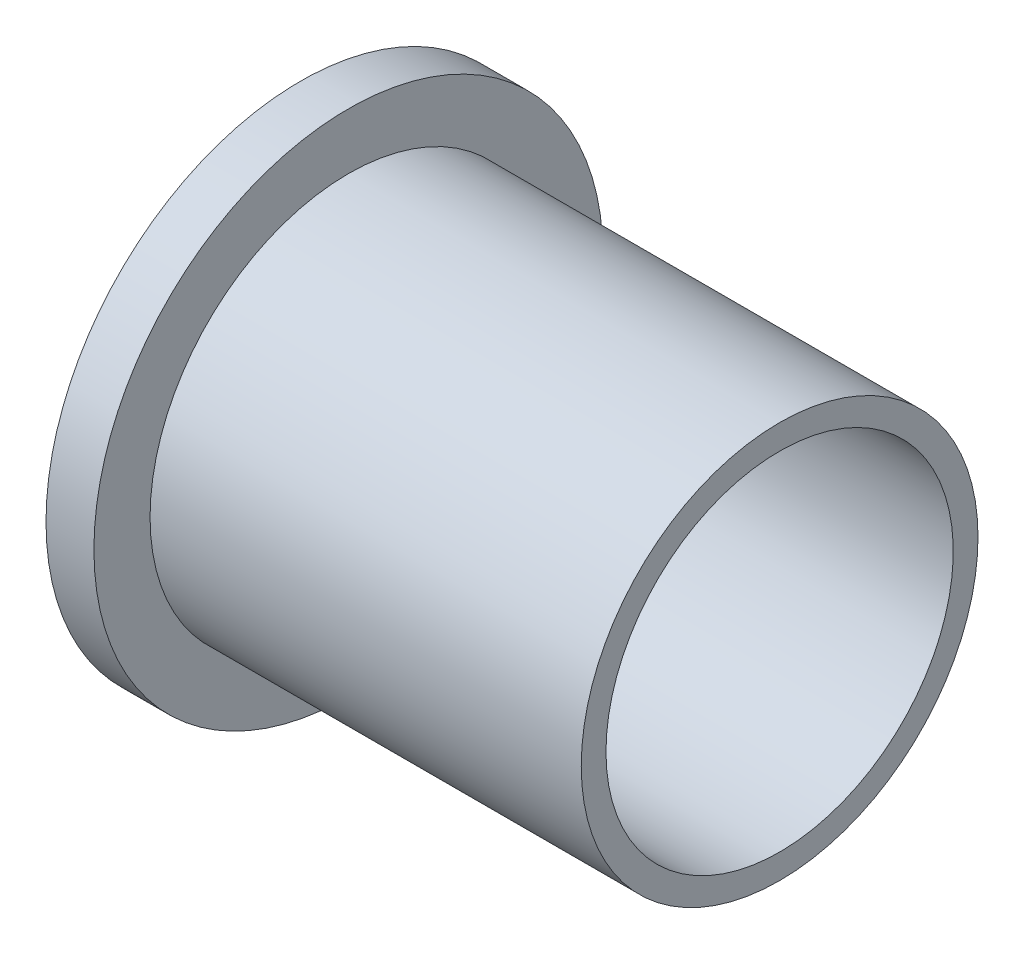
ISO-10303-21;
HEADER;
FILE_DESCRIPTION(('STEP AP214'),'2;1');
FILE_NAME('part.step','',(''),(''),'','','');
FILE_SCHEMA(('AUTOMOTIVE_DESIGN { 1 0 10303 214 1 1 1 1 }'));
ENDSEC;
DATA;
#1=APPLICATION_CONTEXT('core data for automotive mechanical design processes');
#2=APPLICATION_PROTOCOL_DEFINITION('international standard','automotive_design',2000,#1);
#3=PRODUCT_CONTEXT('',#1,'mechanical');
#4=PRODUCT('Part','Part','',(#3));
#5=PRODUCT_RELATED_PRODUCT_CATEGORY('part','',(#4));
#6=PRODUCT_DEFINITION_FORMATION('','',#4);
#7=PRODUCT_DEFINITION_CONTEXT('part definition',#1,'design');
#8=PRODUCT_DEFINITION('design','',#6,#7);
#9=PRODUCT_DEFINITION_SHAPE('','',#8);
#10=(LENGTH_UNIT() NAMED_UNIT(*) SI_UNIT(.MILLI.,.METRE.));
#11=(NAMED_UNIT(*) PLANE_ANGLE_UNIT() SI_UNIT($,.RADIAN.));
#12=(NAMED_UNIT(*) SI_UNIT($,.STERADIAN.) SOLID_ANGLE_UNIT());
#13=UNCERTAINTY_MEASURE_WITH_UNIT(LENGTH_MEASURE(1.E-05),#10,'distance_accuracy_value','');
#14=(GEOMETRIC_REPRESENTATION_CONTEXT(3) GLOBAL_UNCERTAINTY_ASSIGNED_CONTEXT((#13)) GLOBAL_UNIT_ASSIGNED_CONTEXT((#10,
#11,#12)) REPRESENTATION_CONTEXT('',''));
#15=CARTESIAN_POINT('',(0.,0.,0.));
#16=DIRECTION('',(0.,0.,1.));
#17=DIRECTION('',(1.,0.,0.));
#18=AXIS2_PLACEMENT_3D('',#15,#16,#17);
#19=CARTESIAN_POINT('',(0.,0.,0.));
#20=DIRECTION('',(-1.,0.,0.));
#21=DIRECTION('',(0.,0.,1.));
#22=AXIS2_PLACEMENT_3D('',#19,#20,#21);
#23=CYLINDRICAL_SURFACE('',#22,107.95);
#24=CARTESIAN_POINT('',(0.,0.,0.));
#25=DIRECTION('',(-1.,0.,0.));
#26=DIRECTION('',(0.,0.,1.));
#27=AXIS2_PLACEMENT_3D('',#24,#25,#26);
#28=CIRCLE('',#27,107.95);
#29=CARTESIAN_POINT('',(0.,0.,107.95));
#30=VERTEX_POINT('',#29);
#31=EDGE_CURVE('E10',#30,#30,#28,.T.);
#32=ORIENTED_EDGE('',*,*,#31,.F.);
#33=EDGE_LOOP('',(#32));
#34=FACE_BOUND('',#33,.T.);
#35=CARTESIAN_POINT('',(20.32,0.,0.));
#36=DIRECTION('',(-1.,0.,0.));
#37=DIRECTION('',(0.,0.,1.));
#38=AXIS2_PLACEMENT_3D('',#35,#36,#37);
#39=CIRCLE('',#38,107.95);
#40=CARTESIAN_POINT('',(20.32,0.,107.95));
#41=VERTEX_POINT('',#40);
#42=EDGE_CURVE('E59',#41,#41,#39,.T.);
#43=ORIENTED_EDGE('',*,*,#42,.T.);
#44=EDGE_LOOP('',(#43));
#45=FACE_BOUND('',#44,.T.);
#46=ADVANCED_FACE('F37',(#34,#45),#23,.T.);
#47=CARTESIAN_POINT('',(0.,107.95,0.));
#48=DIRECTION('',(1.,0.,0.));
#49=DIRECTION('',(0.,0.,-1.));
#50=AXIS2_PLACEMENT_3D('',#47,#48,#49);
#51=PLANE('',#50);
#52=CARTESIAN_POINT('',(0.,0.,0.));
#53=DIRECTION('',(-1.,0.,0.));
#54=DIRECTION('',(0.,0.,1.));
#55=AXIS2_PLACEMENT_3D('',#52,#53,#54);
#56=CIRCLE('',#55,73.6473);
#57=CARTESIAN_POINT('',(0.,0.,73.6473));
#58=VERTEX_POINT('',#57);
#59=EDGE_CURVE('E43',#58,#58,#56,.T.);
#60=ORIENTED_EDGE('',*,*,#59,.F.);
#61=EDGE_LOOP('',(#60));
#62=FACE_BOUND('',#61,.T.);
#63=ORIENTED_EDGE('',*,*,#31,.T.);
#64=EDGE_LOOP('',(#63));
#65=FACE_BOUND('',#64,.T.);
#66=ADVANCED_FACE('F84',(#62,#65),#51,.F.);
#67=CARTESIAN_POINT('',(0.,0.,0.));
#68=DIRECTION('',(-1.,0.,0.));
#69=DIRECTION('',(0.,0.,1.));
#70=AXIS2_PLACEMENT_3D('',#67,#68,#69);
#71=CYLINDRICAL_SURFACE('',#70,73.6473);
#72=CARTESIAN_POINT('',(203.2,0.,0.));
#73=DIRECTION('',(-1.,0.,0.));
#74=DIRECTION('',(0.,0.,1.));
#75=AXIS2_PLACEMENT_3D('',#72,#73,#74);
#76=CIRCLE('',#75,73.6473);
#77=CARTESIAN_POINT('',(203.2,0.,73.6473));
#78=VERTEX_POINT('',#77);
#79=EDGE_CURVE('E47',#78,#78,#76,.T.);
#80=ORIENTED_EDGE('',*,*,#79,.F.);
#81=EDGE_LOOP('',(#80));
#82=FACE_BOUND('',#81,.T.);
#83=ORIENTED_EDGE('',*,*,#59,.T.);
#84=EDGE_LOOP('',(#83));
#85=FACE_BOUND('',#84,.T.);
#86=ADVANCED_FACE('F79',(#82,#85),#71,.F.);
#87=CARTESIAN_POINT('',(203.2,73.6473,0.));
#88=DIRECTION('',(-1.,0.,0.));
#89=DIRECTION('',(0.,0.,1.));
#90=AXIS2_PLACEMENT_3D('',#87,#88,#89);
#91=PLANE('',#90);
#92=CARTESIAN_POINT('',(203.2,0.,0.));
#93=DIRECTION('',(-1.,0.,0.));
#94=DIRECTION('',(0.,0.,1.));
#95=AXIS2_PLACEMENT_3D('',#92,#93,#94);
#96=CIRCLE('',#95,84.1375);
#97=CARTESIAN_POINT('',(203.2,0.,84.1375));
#98=VERTEX_POINT('',#97);
#99=EDGE_CURVE('E51',#98,#98,#96,.T.);
#100=ORIENTED_EDGE('',*,*,#99,.F.);
#101=EDGE_LOOP('',(#100));
#102=FACE_BOUND('',#101,.T.);
#103=ORIENTED_EDGE('',*,*,#79,.T.);
#104=EDGE_LOOP('',(#103));
#105=FACE_BOUND('',#104,.T.);
#106=ADVANCED_FACE('F73',(#102,#105),#91,.F.);
#107=CARTESIAN_POINT('',(0.,0.,0.));
#108=DIRECTION('',(-1.,0.,0.));
#109=DIRECTION('',(0.,0.,1.));
#110=AXIS2_PLACEMENT_3D('',#107,#108,#109);
#111=CYLINDRICAL_SURFACE('',#110,84.1375);
#112=CARTESIAN_POINT('',(20.32,0.,0.));
#113=DIRECTION('',(-1.,0.,0.));
#114=DIRECTION('',(0.,0.,1.));
#115=AXIS2_PLACEMENT_3D('',#112,#113,#114);
#116=CIRCLE('',#115,84.1375);
#117=CARTESIAN_POINT('',(20.32,0.,84.1375));
#118=VERTEX_POINT('',#117);
#119=EDGE_CURVE('E56',#118,#118,#116,.T.);
#120=ORIENTED_EDGE('',*,*,#119,.F.);
#121=EDGE_LOOP('',(#120));
#122=FACE_BOUND('',#121,.T.);
#123=ORIENTED_EDGE('',*,*,#99,.T.);
#124=EDGE_LOOP('',(#123));
#125=FACE_BOUND('',#124,.T.);
#126=ADVANCED_FACE('F67',(#122,#125),#111,.T.);
#127=CARTESIAN_POINT('',(20.32,84.1375,0.));
#128=DIRECTION('',(-1.,0.,0.));
#129=DIRECTION('',(0.,0.,1.));
#130=AXIS2_PLACEMENT_3D('',#127,#128,#129);
#131=PLANE('',#130);
#132=ORIENTED_EDGE('',*,*,#42,.F.);
#133=EDGE_LOOP('',(#132));
#134=FACE_BOUND('',#133,.T.);
#135=ORIENTED_EDGE('',*,*,#119,.T.);
#136=EDGE_LOOP('',(#135));
#137=FACE_BOUND('',#136,.T.);
#138=ADVANCED_FACE('F64',(#134,#137),#131,.F.);
#139=CLOSED_SHELL('',(#46,#66,#86,#106,#126,#138));
#140=MANIFOLD_SOLID_BREP('B2',#139);
#141=ADVANCED_BREP_SHAPE_REPRESENTATION('',(#18,#140),#14);
#142=SHAPE_DEFINITION_REPRESENTATION(#9,#141);
ENDSEC;
END-ISO-10303-21;
